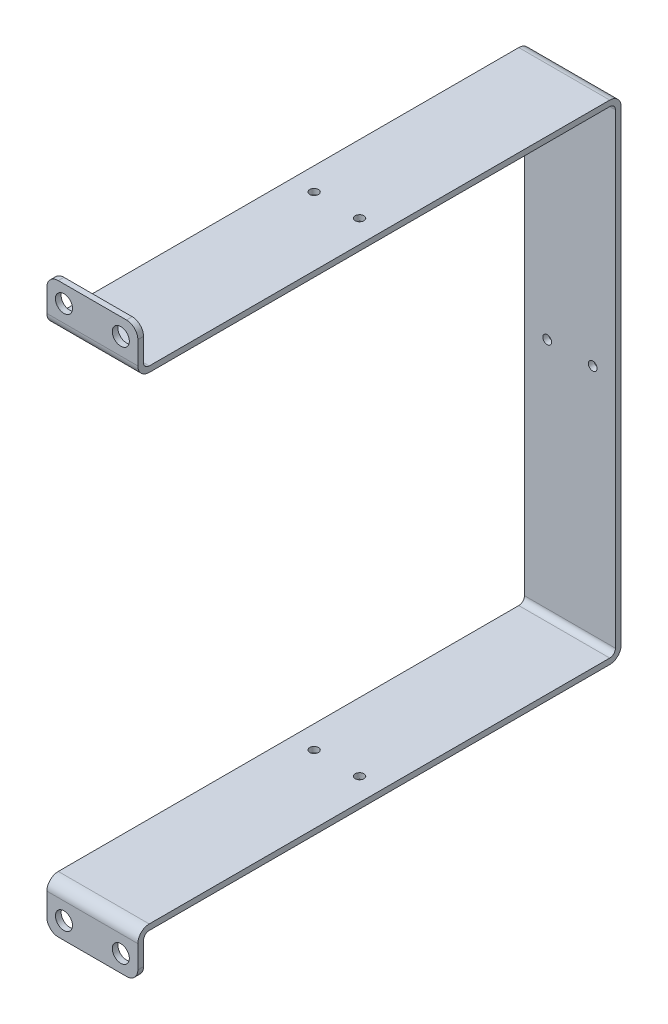
ISO-10303-21;
HEADER;
FILE_DESCRIPTION(('STEP AP214'),'2;1');
FILE_NAME('part.step','',(''),(''),'','','');
FILE_SCHEMA(('AUTOMOTIVE_DESIGN { 1 0 10303 214 1 1 1 1 }'));
ENDSEC;
DATA;
#1=APPLICATION_CONTEXT('core data for automotive mechanical design processes');
#2=APPLICATION_PROTOCOL_DEFINITION('international standard','automotive_design',2000,#1);
#3=PRODUCT_CONTEXT('',#1,'mechanical');
#4=PRODUCT('Part','Part','',(#3));
#5=PRODUCT_RELATED_PRODUCT_CATEGORY('part','',(#4));
#6=PRODUCT_DEFINITION_FORMATION('','',#4);
#7=PRODUCT_DEFINITION_CONTEXT('part definition',#1,'design');
#8=PRODUCT_DEFINITION('design','',#6,#7);
#9=PRODUCT_DEFINITION_SHAPE('','',#8);
#10=(LENGTH_UNIT() NAMED_UNIT(*) SI_UNIT(.MILLI.,.METRE.));
#11=(NAMED_UNIT(*) PLANE_ANGLE_UNIT() SI_UNIT($,.RADIAN.));
#12=(NAMED_UNIT(*) SI_UNIT($,.STERADIAN.) SOLID_ANGLE_UNIT());
#13=UNCERTAINTY_MEASURE_WITH_UNIT(LENGTH_MEASURE(1.E-05),#10,'distance_accuracy_value','');
#14=(GEOMETRIC_REPRESENTATION_CONTEXT(3) GLOBAL_UNCERTAINTY_ASSIGNED_CONTEXT((#13)) GLOBAL_UNIT_ASSIGNED_CONTEXT((#10,
#11,#12)) REPRESENTATION_CONTEXT('',''));
#15=CARTESIAN_POINT('',(0.,0.,0.));
#16=DIRECTION('',(0.,0.,1.));
#17=DIRECTION('',(1.,0.,0.));
#18=AXIS2_PLACEMENT_3D('',#15,#16,#17);
#19=CARTESIAN_POINT('',(50.8,133.35,269.875));
#20=DIRECTION('',(0.,0.,1.));
#21=DIRECTION('',(1.,0.,0.));
#22=AXIS2_PLACEMENT_3D('',#19,#20,#21);
#23=PLANE('',#22);
#24=CARTESIAN_POINT('',(9.525,149.225,269.875));
#25=DIRECTION('',(0.,0.,1.));
#26=DIRECTION('',(1.,0.,0.));
#27=AXIS2_PLACEMENT_3D('',#24,#25,#26);
#28=CIRCLE('',#27,4.7625);
#29=CARTESIAN_POINT('',(14.2875,149.225,269.875));
#30=VERTEX_POINT('',#29);
#31=EDGE_CURVE('E327',#30,#30,#28,.F.);
#32=ORIENTED_EDGE('',*,*,#31,.T.);
#33=EDGE_LOOP('',(#32));
#34=FACE_BOUND('',#33,.T.);
#35=CARTESIAN_POINT('',(41.275,149.225,269.875));
#36=DIRECTION('',(0.,0.,1.));
#37=DIRECTION('',(1.,0.,0.));
#38=AXIS2_PLACEMENT_3D('',#35,#36,#37);
#39=CIRCLE('',#38,4.7625);
#40=CARTESIAN_POINT('',(46.0375,149.225,269.875));
#41=VERTEX_POINT('',#40);
#42=EDGE_CURVE('E331',#41,#41,#39,.F.);
#43=ORIENTED_EDGE('',*,*,#42,.T.);
#44=EDGE_LOOP('',(#43));
#45=FACE_BOUND('',#44,.T.);
#46=DIRECTION('',(0.,1.,0.));
#47=VECTOR('',#46,1.);
#48=CARTESIAN_POINT('',(50.8,149.225,269.875));
#49=LINE('',#48,#47);
#50=CARTESIAN_POINT('',(50.8,152.4,269.875));
#51=VERTEX_POINT('',#50);
#52=CARTESIAN_POINT('',(50.8,139.7,269.875));
#53=VERTEX_POINT('',#52);
#54=EDGE_CURVE('E330',#51,#53,#49,.F.);
#55=ORIENTED_EDGE('',*,*,#54,.F.);
#56=CARTESIAN_POINT('',(44.45,152.4,269.875));
#57=DIRECTION('',(0.,0.,1.));
#58=DIRECTION('',(1.,0.,0.));
#59=AXIS2_PLACEMENT_3D('',#56,#57,#58);
#60=CIRCLE('',#59,6.35);
#61=CARTESIAN_POINT('',(44.45,158.75,269.875));
#62=VERTEX_POINT('',#61);
#63=EDGE_CURVE('E197',#62,#51,#60,.F.);
#64=ORIENTED_EDGE('',*,*,#63,.F.);
#65=DIRECTION('',(1.,0.,0.));
#66=VECTOR('',#65,1.);
#67=CARTESIAN_POINT('',(25.4,158.75,269.875));
#68=LINE('',#67,#66);
#69=CARTESIAN_POINT('',(6.35,158.75,269.875));
#70=VERTEX_POINT('',#69);
#71=EDGE_CURVE('E199',#70,#62,#68,.T.);
#72=ORIENTED_EDGE('',*,*,#71,.F.);
#73=CARTESIAN_POINT('',(6.35,152.4,269.875));
#74=DIRECTION('',(0.,0.,1.));
#75=DIRECTION('',(1.,0.,0.));
#76=AXIS2_PLACEMENT_3D('',#73,#74,#75);
#77=CIRCLE('',#76,6.35);
#78=CARTESIAN_POINT('',(0.,152.4,269.875));
#79=VERTEX_POINT('',#78);
#80=EDGE_CURVE('E334',#79,#70,#77,.F.);
#81=ORIENTED_EDGE('',*,*,#80,.F.);
#82=DIRECTION('',(0.,1.,0.));
#83=VECTOR('',#82,1.);
#84=CARTESIAN_POINT('',(0.,149.225,269.875));
#85=LINE('',#84,#83);
#86=CARTESIAN_POINT('',(0.,139.7,269.875));
#87=VERTEX_POINT('',#86);
#88=EDGE_CURVE('E372',#87,#79,#85,.T.);
#89=ORIENTED_EDGE('',*,*,#88,.F.);
#90=DIRECTION('',(1.,0.,0.));
#91=VECTOR('',#90,1.);
#92=CARTESIAN_POINT('',(0.,139.7,269.875));
#93=LINE('',#92,#91);
#94=EDGE_CURVE('E369',#53,#87,#93,.F.);
#95=ORIENTED_EDGE('',*,*,#94,.F.);
#96=EDGE_LOOP('',(#55,#64,#72,#81,#89,#95));
#97=FACE_BOUND('',#96,.T.);
#98=ADVANCED_FACE('F17',(#34,#45,#97),#23,.T.);
#99=CARTESIAN_POINT('',(0.,-133.35,269.875));
#100=DIRECTION('',(0.,0.,1.));
#101=DIRECTION('',(1.,0.,0.));
#102=AXIS2_PLACEMENT_3D('',#99,#100,#101);
#103=PLANE('',#102);
#104=CARTESIAN_POINT('',(9.525,-149.225,269.875));
#105=DIRECTION('',(0.,0.,-1.));
#106=DIRECTION('',(-1.,0.,0.));
#107=AXIS2_PLACEMENT_3D('',#104,#105,#106);
#108=CIRCLE('',#107,4.7625);
#109=CARTESIAN_POINT('',(4.7625,-149.225,269.875));
#110=VERTEX_POINT('',#109);
#111=EDGE_CURVE('E338',#110,#110,#108,.T.);
#112=ORIENTED_EDGE('',*,*,#111,.T.);
#113=EDGE_LOOP('',(#112));
#114=FACE_BOUND('',#113,.T.);
#115=CARTESIAN_POINT('',(41.275,-149.225,269.875));
#116=DIRECTION('',(0.,0.,-1.));
#117=DIRECTION('',(-1.,0.,0.));
#118=AXIS2_PLACEMENT_3D('',#115,#116,#117);
#119=CIRCLE('',#118,4.7625);
#120=CARTESIAN_POINT('',(36.5125,-149.225,269.875));
#121=VERTEX_POINT('',#120);
#122=EDGE_CURVE('E342',#121,#121,#119,.T.);
#123=ORIENTED_EDGE('',*,*,#122,.T.);
#124=EDGE_LOOP('',(#123));
#125=FACE_BOUND('',#124,.T.);
#126=DIRECTION('',(1.,0.,0.));
#127=VECTOR('',#126,1.);
#128=CARTESIAN_POINT('',(25.4,-158.75,269.875));
#129=LINE('',#128,#127);
#130=CARTESIAN_POINT('',(44.45,-158.75,269.875));
#131=VERTEX_POINT('',#130);
#132=CARTESIAN_POINT('',(6.35,-158.75,269.875));
#133=VERTEX_POINT('',#132);
#134=EDGE_CURVE('E189',#131,#133,#129,.F.);
#135=ORIENTED_EDGE('',*,*,#134,.F.);
#136=CARTESIAN_POINT('',(44.45,-152.4,269.875));
#137=DIRECTION('',(0.,0.,1.));
#138=DIRECTION('',(1.,0.,0.));
#139=AXIS2_PLACEMENT_3D('',#136,#137,#138);
#140=CIRCLE('',#139,6.35);
#141=CARTESIAN_POINT('',(50.8,-152.4,269.875));
#142=VERTEX_POINT('',#141);
#143=EDGE_CURVE('E20',#142,#131,#140,.F.);
#144=ORIENTED_EDGE('',*,*,#143,.F.);
#145=DIRECTION('',(0.,1.,0.));
#146=VECTOR('',#145,1.);
#147=CARTESIAN_POINT('',(50.8,-149.225,269.875));
#148=LINE('',#147,#146);
#149=CARTESIAN_POINT('',(50.8,-139.7,269.875));
#150=VERTEX_POINT('',#149);
#151=EDGE_CURVE('E171',#150,#142,#148,.F.);
#152=ORIENTED_EDGE('',*,*,#151,.F.);
#153=DIRECTION('',(-1.,0.,0.));
#154=VECTOR('',#153,1.);
#155=CARTESIAN_POINT('',(50.8,-139.7,269.875));
#156=LINE('',#155,#154);
#157=CARTESIAN_POINT('',(0.,-139.7,269.875));
#158=VERTEX_POINT('',#157);
#159=EDGE_CURVE('E326',#158,#150,#156,.F.);
#160=ORIENTED_EDGE('',*,*,#159,.F.);
#161=DIRECTION('',(0.,1.,0.));
#162=VECTOR('',#161,1.);
#163=CARTESIAN_POINT('',(0.,-149.225,269.875));
#164=LINE('',#163,#162);
#165=CARTESIAN_POINT('',(0.,-152.4,269.875));
#166=VERTEX_POINT('',#165);
#167=EDGE_CURVE('E341',#166,#158,#164,.T.);
#168=ORIENTED_EDGE('',*,*,#167,.F.);
#169=CARTESIAN_POINT('',(6.35,-152.4,269.875));
#170=DIRECTION('',(0.,0.,1.));
#171=DIRECTION('',(1.,0.,0.));
#172=AXIS2_PLACEMENT_3D('',#169,#170,#171);
#173=CIRCLE('',#172,6.35);
#174=EDGE_CURVE('E193',#133,#166,#173,.F.);
#175=ORIENTED_EDGE('',*,*,#174,.F.);
#176=EDGE_LOOP('',(#135,#144,#152,#160,#168,#175));
#177=FACE_BOUND('',#176,.T.);
#178=ADVANCED_FACE('F187',(#114,#125,#177),#103,.T.);
#179=CARTESIAN_POINT('',(44.45,-152.4,-351.80905));
#180=DIRECTION('',(0.,0.,1.));
#181=DIRECTION('',(1.,0.,0.));
#182=AXIS2_PLACEMENT_3D('',#179,#180,#181);
#183=CYLINDRICAL_SURFACE('',#182,6.35);
#184=DIRECTION('',(0.,0.,-1.));
#185=VECTOR('',#184,1.);
#186=CARTESIAN_POINT('',(50.8,-152.4,268.2875));
#187=LINE('',#186,#185);
#188=CARTESIAN_POINT('',(50.8,-152.4,266.7));
#189=VERTEX_POINT('',#188);
#190=EDGE_CURVE('E176',#142,#189,#187,.T.);
#191=ORIENTED_EDGE('',*,*,#190,.F.);
#192=ORIENTED_EDGE('',*,*,#143,.T.);
#193=DIRECTION('',(0.,0.,-1.));
#194=VECTOR('',#193,1.);
#195=CARTESIAN_POINT('',(44.45,-158.75,268.2875));
#196=LINE('',#195,#194);
#197=CARTESIAN_POINT('',(44.45,-158.75,266.7));
#198=VERTEX_POINT('',#197);
#199=EDGE_CURVE('E344',#198,#131,#196,.F.);
#200=ORIENTED_EDGE('',*,*,#199,.F.);
#201=CARTESIAN_POINT('',(44.45,-152.4,266.7));
#202=DIRECTION('',(0.,0.,1.));
#203=DIRECTION('',(1.,0.,0.));
#204=AXIS2_PLACEMENT_3D('',#201,#202,#203);
#205=CIRCLE('',#204,6.35);
#206=EDGE_CURVE('E196',#198,#189,#205,.T.);
#207=ORIENTED_EDGE('',*,*,#206,.T.);
#208=EDGE_LOOP('',(#191,#192,#200,#207));
#209=FACE_BOUND('',#208,.T.);
#210=ADVANCED_FACE('F195',(#209),#183,.T.);
#211=CARTESIAN_POINT('',(6.35,-152.4,-351.80905));
#212=DIRECTION('',(0.,0.,1.));
#213=DIRECTION('',(1.,0.,0.));
#214=AXIS2_PLACEMENT_3D('',#211,#212,#213);
#215=CYLINDRICAL_SURFACE('',#214,6.35);
#216=DIRECTION('',(0.,0.,-1.));
#217=VECTOR('',#216,1.);
#218=CARTESIAN_POINT('',(6.35,-158.75,268.2875));
#219=LINE('',#218,#217);
#220=CARTESIAN_POINT('',(6.35,-158.75,266.7));
#221=VERTEX_POINT('',#220);
#222=EDGE_CURVE('E206',#133,#221,#219,.T.);
#223=ORIENTED_EDGE('',*,*,#222,.F.);
#224=ORIENTED_EDGE('',*,*,#174,.T.);
#225=DIRECTION('',(0.,0.,1.));
#226=VECTOR('',#225,1.);
#227=CARTESIAN_POINT('',(0.,-152.4,268.2875));
#228=LINE('',#227,#226);
#229=CARTESIAN_POINT('',(0.,-152.4,266.7));
#230=VERTEX_POINT('',#229);
#231=EDGE_CURVE('E183',#230,#166,#228,.T.);
#232=ORIENTED_EDGE('',*,*,#231,.F.);
#233=CARTESIAN_POINT('',(6.35,-152.4,266.7));
#234=DIRECTION('',(0.,0.,1.));
#235=DIRECTION('',(1.,0.,0.));
#236=AXIS2_PLACEMENT_3D('',#233,#234,#235);
#237=CIRCLE('',#236,6.35);
#238=EDGE_CURVE('E320',#230,#221,#237,.T.);
#239=ORIENTED_EDGE('',*,*,#238,.T.);
#240=EDGE_LOOP('',(#223,#224,#232,#239));
#241=FACE_BOUND('',#240,.T.);
#242=ADVANCED_FACE('F348',(#241),#215,.T.);
#243=CARTESIAN_POINT('',(25.4,-158.75,268.2875));
#244=DIRECTION('',(0.,-1.,0.));
#245=DIRECTION('',(0.,0.,-1.));
#246=AXIS2_PLACEMENT_3D('',#243,#244,#245);
#247=PLANE('',#246);
#248=DIRECTION('',(1.,0.,0.));
#249=VECTOR('',#248,1.);
#250=CARTESIAN_POINT('',(0.,-158.75,266.7));
#251=LINE('',#250,#249);
#252=EDGE_CURVE('E319',#221,#198,#251,.T.);
#253=ORIENTED_EDGE('',*,*,#252,.T.);
#254=ORIENTED_EDGE('',*,*,#199,.T.);
#255=ORIENTED_EDGE('',*,*,#134,.T.);
#256=ORIENTED_EDGE('',*,*,#222,.T.);
#257=EDGE_LOOP('',(#253,#254,#255,#256));
#258=FACE_BOUND('',#257,.T.);
#259=ADVANCED_FACE('F360',(#258),#247,.T.);
#260=CARTESIAN_POINT('',(41.275,-149.225,269.875));
#261=DIRECTION('',(0.,0.,-1.));
#262=DIRECTION('',(-1.,0.,0.));
#263=AXIS2_PLACEMENT_3D('',#260,#261,#262);
#264=CYLINDRICAL_SURFACE('',#263,4.7625);
#265=CARTESIAN_POINT('',(41.275,-149.225,266.7));
#266=DIRECTION('',(0.,0.,-1.));
#267=DIRECTION('',(-1.,0.,0.));
#268=AXIS2_PLACEMENT_3D('',#265,#266,#267);
#269=CIRCLE('',#268,4.7625);
#270=CARTESIAN_POINT('',(36.5125,-149.225,266.7));
#271=VERTEX_POINT('',#270);
#272=EDGE_CURVE('E316',#271,#271,#269,.T.);
#273=ORIENTED_EDGE('',*,*,#272,.T.);
#274=EDGE_LOOP('',(#273));
#275=FACE_BOUND('',#274,.T.);
#276=ORIENTED_EDGE('',*,*,#122,.F.);
#277=EDGE_LOOP('',(#276));
#278=FACE_BOUND('',#277,.T.);
#279=ADVANCED_FACE('F746',(#275,#278),#264,.F.);
#280=CARTESIAN_POINT('',(9.525,-149.225,269.875));
#281=DIRECTION('',(0.,0.,-1.));
#282=DIRECTION('',(-1.,0.,0.));
#283=AXIS2_PLACEMENT_3D('',#280,#281,#282);
#284=CYLINDRICAL_SURFACE('',#283,4.7625);
#285=CARTESIAN_POINT('',(9.525,-149.225,266.7));
#286=DIRECTION('',(0.,0.,-1.));
#287=DIRECTION('',(-1.,0.,0.));
#288=AXIS2_PLACEMENT_3D('',#285,#286,#287);
#289=CIRCLE('',#288,4.7625);
#290=CARTESIAN_POINT('',(4.7625,-149.225,266.7));
#291=VERTEX_POINT('',#290);
#292=EDGE_CURVE('E313',#291,#291,#289,.T.);
#293=ORIENTED_EDGE('',*,*,#292,.T.);
#294=EDGE_LOOP('',(#293));
#295=FACE_BOUND('',#294,.T.);
#296=ORIENTED_EDGE('',*,*,#111,.F.);
#297=EDGE_LOOP('',(#296));
#298=FACE_BOUND('',#297,.T.);
#299=ADVANCED_FACE('F737',(#295,#298),#284,.F.);
#300=CARTESIAN_POINT('',(44.45,152.4,-351.80905));
#301=DIRECTION('',(0.,0.,1.));
#302=DIRECTION('',(1.,0.,0.));
#303=AXIS2_PLACEMENT_3D('',#300,#301,#302);
#304=CYLINDRICAL_SURFACE('',#303,6.35);
#305=DIRECTION('',(0.,0.,1.));
#306=VECTOR('',#305,1.);
#307=CARTESIAN_POINT('',(44.45,158.75,268.2875));
#308=LINE('',#307,#306);
#309=CARTESIAN_POINT('',(44.45,158.75,266.7));
#310=VERTEX_POINT('',#309);
#311=EDGE_CURVE('E205',#62,#310,#308,.F.);
#312=ORIENTED_EDGE('',*,*,#311,.F.);
#313=ORIENTED_EDGE('',*,*,#63,.T.);
#314=DIRECTION('',(0.,0.,-1.));
#315=VECTOR('',#314,1.);
#316=CARTESIAN_POINT('',(50.8,152.4,268.2875));
#317=LINE('',#316,#315);
#318=CARTESIAN_POINT('',(50.8,152.4,266.7));
#319=VERTEX_POINT('',#318);
#320=EDGE_CURVE('E374',#319,#51,#317,.F.);
#321=ORIENTED_EDGE('',*,*,#320,.F.);
#322=CARTESIAN_POINT('',(44.45,152.4,266.7));
#323=DIRECTION('',(0.,0.,1.));
#324=DIRECTION('',(1.,0.,0.));
#325=AXIS2_PLACEMENT_3D('',#322,#323,#324);
#326=CIRCLE('',#325,6.35);
#327=EDGE_CURVE('E306',#319,#310,#326,.T.);
#328=ORIENTED_EDGE('',*,*,#327,.T.);
#329=EDGE_LOOP('',(#312,#313,#321,#328));
#330=FACE_BOUND('',#329,.T.);
#331=ADVANCED_FACE('F728',(#330),#304,.T.);
#332=CARTESIAN_POINT('',(25.4,158.75,268.2875));
#333=DIRECTION('',(0.,1.,0.));
#334=DIRECTION('',(0.,0.,1.));
#335=AXIS2_PLACEMENT_3D('',#332,#333,#334);
#336=PLANE('',#335);
#337=ORIENTED_EDGE('',*,*,#71,.T.);
#338=ORIENTED_EDGE('',*,*,#311,.T.);
#339=DIRECTION('',(1.,0.,0.));
#340=VECTOR('',#339,1.);
#341=CARTESIAN_POINT('',(50.8,158.75,266.7));
#342=LINE('',#341,#340);
#343=CARTESIAN_POINT('',(6.35,158.75,266.7));
#344=VERTEX_POINT('',#343);
#345=EDGE_CURVE('E305',#310,#344,#342,.F.);
#346=ORIENTED_EDGE('',*,*,#345,.T.);
#347=DIRECTION('',(0.,0.,1.));
#348=VECTOR('',#347,1.);
#349=CARTESIAN_POINT('',(6.35,158.75,-351.80905));
#350=LINE('',#349,#348);
#351=EDGE_CURVE('E336',#70,#344,#350,.F.);
#352=ORIENTED_EDGE('',*,*,#351,.F.);
#353=EDGE_LOOP('',(#337,#338,#346,#352));
#354=FACE_BOUND('',#353,.T.);
#355=ADVANCED_FACE('F719',(#354),#336,.T.);
#356=CARTESIAN_POINT('',(6.35,152.4,-351.80905));
#357=DIRECTION('',(0.,0.,1.));
#358=DIRECTION('',(1.,0.,0.));
#359=AXIS2_PLACEMENT_3D('',#356,#357,#358);
#360=CYLINDRICAL_SURFACE('',#359,6.35);
#361=DIRECTION('',(0.,0.,1.));
#362=VECTOR('',#361,1.);
#363=CARTESIAN_POINT('',(0.,152.4,268.2875));
#364=LINE('',#363,#362);
#365=CARTESIAN_POINT('',(0.,152.4,266.7));
#366=VERTEX_POINT('',#365);
#367=EDGE_CURVE('E371',#79,#366,#364,.F.);
#368=ORIENTED_EDGE('',*,*,#367,.F.);
#369=ORIENTED_EDGE('',*,*,#80,.T.);
#370=ORIENTED_EDGE('',*,*,#351,.T.);
#371=CARTESIAN_POINT('',(6.35,152.4,266.7));
#372=DIRECTION('',(0.,0.,1.));
#373=DIRECTION('',(1.,0.,0.));
#374=AXIS2_PLACEMENT_3D('',#371,#372,#373);
#375=CIRCLE('',#374,6.35);
#376=EDGE_CURVE('E301',#344,#366,#375,.T.);
#377=ORIENTED_EDGE('',*,*,#376,.T.);
#378=EDGE_LOOP('',(#368,#369,#370,#377));
#379=FACE_BOUND('',#378,.T.);
#380=ADVANCED_FACE('F710',(#379),#360,.T.);
#381=CARTESIAN_POINT('',(41.275,149.225,269.875));
#382=DIRECTION('',(0.,0.,1.));
#383=DIRECTION('',(1.,0.,0.));
#384=AXIS2_PLACEMENT_3D('',#381,#382,#383);
#385=CYLINDRICAL_SURFACE('',#384,4.7625);
#386=ORIENTED_EDGE('',*,*,#42,.F.);
#387=EDGE_LOOP('',(#386));
#388=FACE_BOUND('',#387,.T.);
#389=CARTESIAN_POINT('',(41.275,149.225,266.7));
#390=DIRECTION('',(0.,0.,1.));
#391=DIRECTION('',(1.,0.,0.));
#392=AXIS2_PLACEMENT_3D('',#389,#390,#391);
#393=CIRCLE('',#392,4.7625);
#394=CARTESIAN_POINT('',(46.0375,149.225,266.7));
#395=VERTEX_POINT('',#394);
#396=EDGE_CURVE('E297',#395,#395,#393,.F.);
#397=ORIENTED_EDGE('',*,*,#396,.T.);
#398=EDGE_LOOP('',(#397));
#399=FACE_BOUND('',#398,.T.);
#400=ADVANCED_FACE('F701',(#388,#399),#385,.F.);
#401=CARTESIAN_POINT('',(9.525,149.225,269.875));
#402=DIRECTION('',(0.,0.,1.));
#403=DIRECTION('',(1.,0.,0.));
#404=AXIS2_PLACEMENT_3D('',#401,#402,#403);
#405=CYLINDRICAL_SURFACE('',#404,4.7625);
#406=ORIENTED_EDGE('',*,*,#31,.F.);
#407=EDGE_LOOP('',(#406));
#408=FACE_BOUND('',#407,.T.);
#409=CARTESIAN_POINT('',(9.525,149.225,266.7));
#410=DIRECTION('',(0.,0.,1.));
#411=DIRECTION('',(1.,0.,0.));
#412=AXIS2_PLACEMENT_3D('',#409,#410,#411);
#413=CIRCLE('',#412,4.7625);
#414=CARTESIAN_POINT('',(14.2875,149.225,266.7));
#415=VERTEX_POINT('',#414);
#416=EDGE_CURVE('E294',#415,#415,#413,.F.);
#417=ORIENTED_EDGE('',*,*,#416,.T.);
#418=EDGE_LOOP('',(#417));
#419=FACE_BOUND('',#418,.T.);
#420=ADVANCED_FACE('F692',(#408,#419),#405,.F.);
#421=CARTESIAN_POINT('',(0.,139.7,263.525));
#422=DIRECTION('',(1.,0.,0.));
#423=DIRECTION('',(0.,0.,-1.));
#424=AXIS2_PLACEMENT_3D('',#421,#422,#423);
#425=CYLINDRICAL_SURFACE('',#424,6.35);
#426=CARTESIAN_POINT('',(50.8,139.7,263.525));
#427=DIRECTION('',(1.,0.,0.));
#428=DIRECTION('',(0.,0.,-1.));
#429=AXIS2_PLACEMENT_3D('',#426,#427,#428);
#430=CIRCLE('',#429,6.35);
#431=CARTESIAN_POINT('',(50.8,133.35,263.525));
#432=VERTEX_POINT('',#431);
#433=EDGE_CURVE('E291',#432,#53,#430,.F.);
#434=ORIENTED_EDGE('',*,*,#433,.T.);
#435=ORIENTED_EDGE('',*,*,#94,.T.);
#436=CARTESIAN_POINT('',(0.,139.7,263.525));
#437=DIRECTION('',(1.,0.,0.));
#438=DIRECTION('',(0.,0.,-1.));
#439=AXIS2_PLACEMENT_3D('',#436,#437,#438);
#440=CIRCLE('',#439,6.35);
#441=CARTESIAN_POINT('',(0.,133.35,263.525));
#442=VERTEX_POINT('',#441);
#443=EDGE_CURVE('E287',#442,#87,#440,.F.);
#444=ORIENTED_EDGE('',*,*,#443,.F.);
#445=DIRECTION('',(1.,0.,0.));
#446=VECTOR('',#445,1.);
#447=CARTESIAN_POINT('',(0.,133.35,263.525));
#448=LINE('',#447,#446);
#449=EDGE_CURVE('E290',#442,#432,#448,.T.);
#450=ORIENTED_EDGE('',*,*,#449,.T.);
#451=EDGE_LOOP('',(#434,#435,#444,#450));
#452=FACE_BOUND('',#451,.T.);
#453=ADVANCED_FACE('F684',(#452),#425,.T.);
#454=CARTESIAN_POINT('',(50.8,-139.7,263.525));
#455=DIRECTION('',(-1.,0.,0.));
#456=DIRECTION('',(0.,0.,1.));
#457=AXIS2_PLACEMENT_3D('',#454,#455,#456);
#458=CYLINDRICAL_SURFACE('',#457,6.35);
#459=CARTESIAN_POINT('',(0.,-139.7,263.525));
#460=DIRECTION('',(-1.,0.,0.));
#461=DIRECTION('',(0.,0.,1.));
#462=AXIS2_PLACEMENT_3D('',#459,#460,#461);
#463=CIRCLE('',#462,6.35);
#464=CARTESIAN_POINT('',(0.,-133.35,263.525));
#465=VERTEX_POINT('',#464);
#466=EDGE_CURVE('E310',#465,#158,#463,.F.);
#467=ORIENTED_EDGE('',*,*,#466,.T.);
#468=ORIENTED_EDGE('',*,*,#159,.T.);
#469=CARTESIAN_POINT('',(50.8,-139.7,263.525));
#470=DIRECTION('',(-1.,0.,0.));
#471=DIRECTION('',(0.,0.,1.));
#472=AXIS2_PLACEMENT_3D('',#469,#470,#471);
#473=CIRCLE('',#472,6.35);
#474=CARTESIAN_POINT('',(50.8,-133.35,263.525));
#475=VERTEX_POINT('',#474);
#476=EDGE_CURVE('E180',#475,#150,#473,.F.);
#477=ORIENTED_EDGE('',*,*,#476,.F.);
#478=DIRECTION('',(1.,0.,0.));
#479=VECTOR('',#478,1.);
#480=CARTESIAN_POINT('',(50.8,-133.35,263.525));
#481=LINE('',#480,#479);
#482=EDGE_CURVE('E383',#475,#465,#481,.F.);
#483=ORIENTED_EDGE('',*,*,#482,.T.);
#484=EDGE_LOOP('',(#467,#468,#477,#483));
#485=FACE_BOUND('',#484,.T.);
#486=ADVANCED_FACE('F381',(#485),#458,.T.);
#487=CARTESIAN_POINT('',(0.,-133.35,266.7));
#488=DIRECTION('',(0.,0.,1.));
#489=DIRECTION('',(1.,0.,0.));
#490=AXIS2_PLACEMENT_3D('',#487,#488,#489);
#491=PLANE('',#490);
#492=ORIENTED_EDGE('',*,*,#292,.F.);
#493=EDGE_LOOP('',(#492));
#494=FACE_BOUND('',#493,.T.);
#495=ORIENTED_EDGE('',*,*,#272,.F.);
#496=EDGE_LOOP('',(#495));
#497=FACE_BOUND('',#496,.T.);
#498=ORIENTED_EDGE('',*,*,#238,.F.);
#499=DIRECTION('',(0.,1.,0.));
#500=VECTOR('',#499,1.);
#501=CARTESIAN_POINT('',(0.,-133.35,266.7));
#502=LINE('',#501,#500);
#503=CARTESIAN_POINT('',(0.,-139.7,266.7));
#504=VERTEX_POINT('',#503);
#505=EDGE_CURVE('E323',#504,#230,#502,.F.);
#506=ORIENTED_EDGE('',*,*,#505,.F.);
#507=DIRECTION('',(-1.,0.,0.));
#508=VECTOR('',#507,1.);
#509=CARTESIAN_POINT('',(50.8,-139.7,266.7));
#510=LINE('',#509,#508);
#511=CARTESIAN_POINT('',(50.8,-139.7,266.7));
#512=VERTEX_POINT('',#511);
#513=EDGE_CURVE('E286',#504,#512,#510,.F.);
#514=ORIENTED_EDGE('',*,*,#513,.T.);
#515=DIRECTION('',(0.,1.,0.));
#516=VECTOR('',#515,1.);
#517=CARTESIAN_POINT('',(50.8,-133.35,266.7));
#518=LINE('',#517,#516);
#519=EDGE_CURVE('E325',#189,#512,#518,.T.);
#520=ORIENTED_EDGE('',*,*,#519,.F.);
#521=ORIENTED_EDGE('',*,*,#206,.F.);
#522=ORIENTED_EDGE('',*,*,#252,.F.);
#523=EDGE_LOOP('',(#498,#506,#514,#520,#521,#522));
#524=FACE_BOUND('',#523,.T.);
#525=ADVANCED_FACE('F431',(#494,#497,#524),#491,.F.);
#526=CARTESIAN_POINT('',(50.8,133.35,266.7));
#527=DIRECTION('',(0.,0.,1.));
#528=DIRECTION('',(1.,0.,0.));
#529=AXIS2_PLACEMENT_3D('',#526,#527,#528);
#530=PLANE('',#529);
#531=ORIENTED_EDGE('',*,*,#416,.F.);
#532=EDGE_LOOP('',(#531));
#533=FACE_BOUND('',#532,.T.);
#534=ORIENTED_EDGE('',*,*,#396,.F.);
#535=EDGE_LOOP('',(#534));
#536=FACE_BOUND('',#535,.T.);
#537=DIRECTION('',(1.,0.,0.));
#538=VECTOR('',#537,1.);
#539=CARTESIAN_POINT('',(0.,139.7,266.7));
#540=LINE('',#539,#538);
#541=CARTESIAN_POINT('',(50.8,139.7,266.7));
#542=VERTEX_POINT('',#541);
#543=CARTESIAN_POINT('',(0.,139.7,266.7));
#544=VERTEX_POINT('',#543);
#545=EDGE_CURVE('E272',#542,#544,#540,.F.);
#546=ORIENTED_EDGE('',*,*,#545,.T.);
#547=DIRECTION('',(0.,1.,0.));
#548=VECTOR('',#547,1.);
#549=CARTESIAN_POINT('',(0.,133.35,266.7));
#550=LINE('',#549,#548);
#551=EDGE_CURVE('E304',#366,#544,#550,.F.);
#552=ORIENTED_EDGE('',*,*,#551,.F.);
#553=ORIENTED_EDGE('',*,*,#376,.F.);
#554=ORIENTED_EDGE('',*,*,#345,.F.);
#555=ORIENTED_EDGE('',*,*,#327,.F.);
#556=DIRECTION('',(0.,1.,0.));
#557=VECTOR('',#556,1.);
#558=CARTESIAN_POINT('',(50.8,133.35,266.7));
#559=LINE('',#558,#557);
#560=EDGE_CURVE('E300',#542,#319,#559,.T.);
#561=ORIENTED_EDGE('',*,*,#560,.F.);
#562=EDGE_LOOP('',(#546,#552,#553,#554,#555,#561));
#563=FACE_BOUND('',#562,.T.);
#564=ADVANCED_FACE('F659',(#533,#536,#563),#530,.F.);
#565=CARTESIAN_POINT('',(0.,133.35,0.));
#566=DIRECTION('',(0.,1.,0.));
#567=DIRECTION('',(0.,0.,1.));
#568=AXIS2_PLACEMENT_3D('',#565,#566,#567);
#569=PLANE('',#568);
#570=CARTESIAN_POINT('',(12.7,133.35,133.35));
#571=DIRECTION('',(0.,1.,0.));
#572=DIRECTION('',(0.,0.,1.));
#573=AXIS2_PLACEMENT_3D('',#570,#571,#572);
#574=CIRCLE('',#573,2.4384);
#575=CARTESIAN_POINT('',(12.7,133.35,135.7884));
#576=VERTEX_POINT('',#575);
#577=EDGE_CURVE('E258',#576,#576,#574,.T.);
#578=ORIENTED_EDGE('',*,*,#577,.T.);
#579=EDGE_LOOP('',(#578));
#580=FACE_BOUND('',#579,.T.);
#581=CARTESIAN_POINT('',(38.1,133.35,133.35));
#582=DIRECTION('',(0.,1.,0.));
#583=DIRECTION('',(0.,0.,1.));
#584=AXIS2_PLACEMENT_3D('',#581,#582,#583);
#585=CIRCLE('',#584,2.4384);
#586=CARTESIAN_POINT('',(38.1,133.35,135.7884));
#587=VERTEX_POINT('',#586);
#588=EDGE_CURVE('E262',#587,#587,#585,.T.);
#589=ORIENTED_EDGE('',*,*,#588,.T.);
#590=EDGE_LOOP('',(#589));
#591=FACE_BOUND('',#590,.T.);
#592=DIRECTION('',(0.,0.,-1.));
#593=VECTOR('',#592,1.);
#594=CARTESIAN_POINT('',(50.8,133.35,138.1125));
#595=LINE('',#594,#593);
#596=CARTESIAN_POINT('',(50.8,133.35,6.35));
#597=VERTEX_POINT('',#596);
#598=EDGE_CURVE('E269',#432,#597,#595,.T.);
#599=ORIENTED_EDGE('',*,*,#598,.F.);
#600=ORIENTED_EDGE('',*,*,#449,.F.);
#601=DIRECTION('',(0.,0.,1.));
#602=VECTOR('',#601,1.);
#603=CARTESIAN_POINT('',(0.,133.35,138.1125));
#604=LINE('',#603,#602);
#605=CARTESIAN_POINT('',(0.,133.35,6.35));
#606=VERTEX_POINT('',#605);
#607=EDGE_CURVE('E265',#606,#442,#604,.T.);
#608=ORIENTED_EDGE('',*,*,#607,.F.);
#609=DIRECTION('',(-1.,0.,0.));
#610=VECTOR('',#609,1.);
#611=CARTESIAN_POINT('',(50.8,133.35,6.35));
#612=LINE('',#611,#610);
#613=EDGE_CURVE('E261',#606,#597,#612,.F.);
#614=ORIENTED_EDGE('',*,*,#613,.T.);
#615=EDGE_LOOP('',(#599,#600,#608,#614));
#616=FACE_BOUND('',#615,.T.);
#617=ADVANCED_FACE('F650',(#580,#591,#616),#569,.F.);
#618=CARTESIAN_POINT('',(50.8,-133.35,0.));
#619=DIRECTION('',(0.,-1.,0.));
#620=DIRECTION('',(0.,0.,-1.));
#621=AXIS2_PLACEMENT_3D('',#618,#619,#620);
#622=PLANE('',#621);
#623=CARTESIAN_POINT('',(12.7,-133.35,133.35));
#624=DIRECTION('',(0.,1.,0.));
#625=DIRECTION('',(0.,0.,1.));
#626=AXIS2_PLACEMENT_3D('',#623,#624,#625);
#627=CIRCLE('',#626,2.4384);
#628=CARTESIAN_POINT('',(12.7,-133.35,135.7884));
#629=VERTEX_POINT('',#628);
#630=EDGE_CURVE('E273',#629,#629,#627,.F.);
#631=ORIENTED_EDGE('',*,*,#630,.T.);
#632=EDGE_LOOP('',(#631));
#633=FACE_BOUND('',#632,.T.);
#634=CARTESIAN_POINT('',(38.1,-133.35,133.35));
#635=DIRECTION('',(0.,1.,0.));
#636=DIRECTION('',(0.,0.,1.));
#637=AXIS2_PLACEMENT_3D('',#634,#635,#636);
#638=CIRCLE('',#637,2.4384);
#639=CARTESIAN_POINT('',(38.1,-133.35,135.7884));
#640=VERTEX_POINT('',#639);
#641=EDGE_CURVE('E277',#640,#640,#638,.F.);
#642=ORIENTED_EDGE('',*,*,#641,.T.);
#643=EDGE_LOOP('',(#642));
#644=FACE_BOUND('',#643,.T.);
#645=DIRECTION('',(0.,0.,1.));
#646=VECTOR('',#645,1.);
#647=CARTESIAN_POINT('',(0.,-133.35,138.1125));
#648=LINE('',#647,#646);
#649=CARTESIAN_POINT('',(0.,-133.35,6.35));
#650=VERTEX_POINT('',#649);
#651=EDGE_CURVE('E280',#465,#650,#648,.F.);
#652=ORIENTED_EDGE('',*,*,#651,.F.);
#653=ORIENTED_EDGE('',*,*,#482,.F.);
#654=DIRECTION('',(0.,0.,-1.));
#655=VECTOR('',#654,1.);
#656=CARTESIAN_POINT('',(50.8,-133.35,138.1125));
#657=LINE('',#656,#655);
#658=CARTESIAN_POINT('',(50.8,-133.35,6.35));
#659=VERTEX_POINT('',#658);
#660=EDGE_CURVE('E276',#659,#475,#657,.F.);
#661=ORIENTED_EDGE('',*,*,#660,.F.);
#662=DIRECTION('',(1.,0.,0.));
#663=VECTOR('',#662,1.);
#664=CARTESIAN_POINT('',(0.,-133.35,6.35));
#665=LINE('',#664,#663);
#666=EDGE_CURVE('E257',#659,#650,#665,.F.);
#667=ORIENTED_EDGE('',*,*,#666,.T.);
#668=EDGE_LOOP('',(#652,#653,#661,#667));
#669=FACE_BOUND('',#668,.T.);
#670=ADVANCED_FACE('F392',(#633,#644,#669),#622,.F.);
#671=CARTESIAN_POINT('',(50.8,-139.7,263.525));
#672=DIRECTION('',(-1.,0.,0.));
#673=DIRECTION('',(0.,0.,1.));
#674=AXIS2_PLACEMENT_3D('',#671,#672,#673);
#675=CYLINDRICAL_SURFACE('',#674,3.175);
#676=DIRECTION('',(1.,0.,0.));
#677=VECTOR('',#676,1.);
#678=CARTESIAN_POINT('',(50.8,-136.525,263.525));
#679=LINE('',#678,#677);
#680=CARTESIAN_POINT('',(50.8,-136.525,263.525));
#681=VERTEX_POINT('',#680);
#682=CARTESIAN_POINT('',(0.,-136.525,263.525));
#683=VERTEX_POINT('',#682);
#684=EDGE_CURVE('E256',#681,#683,#679,.F.);
#685=ORIENTED_EDGE('',*,*,#684,.F.);
#686=CARTESIAN_POINT('',(50.8,-139.7,263.525));
#687=DIRECTION('',(-1.,0.,0.));
#688=DIRECTION('',(0.,0.,1.));
#689=AXIS2_PLACEMENT_3D('',#686,#687,#688);
#690=CIRCLE('',#689,3.175);
#691=EDGE_CURVE('E284',#512,#681,#690,.T.);
#692=ORIENTED_EDGE('',*,*,#691,.F.);
#693=ORIENTED_EDGE('',*,*,#513,.F.);
#694=CARTESIAN_POINT('',(0.,-139.7,263.525));
#695=DIRECTION('',(-1.,0.,0.));
#696=DIRECTION('',(0.,0.,1.));
#697=AXIS2_PLACEMENT_3D('',#694,#695,#696);
#698=CIRCLE('',#697,3.175);
#699=EDGE_CURVE('E281',#683,#504,#698,.F.);
#700=ORIENTED_EDGE('',*,*,#699,.F.);
#701=EDGE_LOOP('',(#685,#692,#693,#700));
#702=FACE_BOUND('',#701,.T.);
#703=ADVANCED_FACE('F435',(#702),#675,.F.);
#704=CARTESIAN_POINT('',(38.1,-136.525,133.35));
#705=DIRECTION('',(0.,1.,0.));
#706=DIRECTION('',(0.,0.,1.));
#707=AXIS2_PLACEMENT_3D('',#704,#705,#706);
#708=CYLINDRICAL_SURFACE('',#707,2.4384);
#709=ORIENTED_EDGE('',*,*,#641,.F.);
#710=EDGE_LOOP('',(#709));
#711=FACE_BOUND('',#710,.T.);
#712=CARTESIAN_POINT('',(38.1,-136.525,133.35));
#713=DIRECTION('',(0.,1.,0.));
#714=DIRECTION('',(0.,0.,1.));
#715=AXIS2_PLACEMENT_3D('',#712,#713,#714);
#716=CIRCLE('',#715,2.4384);
#717=CARTESIAN_POINT('',(38.1,-136.525,135.7884));
#718=VERTEX_POINT('',#717);
#719=EDGE_CURVE('E250',#718,#718,#716,.T.);
#720=ORIENTED_EDGE('',*,*,#719,.F.);
#721=EDGE_LOOP('',(#720));
#722=FACE_BOUND('',#721,.T.);
#723=ADVANCED_FACE('F626',(#711,#722),#708,.F.);
#724=CARTESIAN_POINT('',(12.7,-136.525,133.35));
#725=DIRECTION('',(0.,1.,0.));
#726=DIRECTION('',(0.,0.,1.));
#727=AXIS2_PLACEMENT_3D('',#724,#725,#726);
#728=CYLINDRICAL_SURFACE('',#727,2.4384);
#729=ORIENTED_EDGE('',*,*,#630,.F.);
#730=EDGE_LOOP('',(#729));
#731=FACE_BOUND('',#730,.T.);
#732=CARTESIAN_POINT('',(12.7,-136.525,133.35));
#733=DIRECTION('',(0.,1.,0.));
#734=DIRECTION('',(0.,0.,1.));
#735=AXIS2_PLACEMENT_3D('',#732,#733,#734);
#736=CIRCLE('',#735,2.4384);
#737=CARTESIAN_POINT('',(12.7,-136.525,135.7884));
#738=VERTEX_POINT('',#737);
#739=EDGE_CURVE('E247',#738,#738,#736,.T.);
#740=ORIENTED_EDGE('',*,*,#739,.F.);
#741=EDGE_LOOP('',(#740));
#742=FACE_BOUND('',#741,.T.);
#743=ADVANCED_FACE('F617',(#731,#742),#728,.F.);
#744=CARTESIAN_POINT('',(0.,139.7,263.525));
#745=DIRECTION('',(1.,0.,0.));
#746=DIRECTION('',(0.,0.,-1.));
#747=AXIS2_PLACEMENT_3D('',#744,#745,#746);
#748=CYLINDRICAL_SURFACE('',#747,3.175);
#749=DIRECTION('',(1.,0.,0.));
#750=VECTOR('',#749,1.);
#751=CARTESIAN_POINT('',(0.,136.525,263.525));
#752=LINE('',#751,#750);
#753=CARTESIAN_POINT('',(0.,136.525,263.525));
#754=VERTEX_POINT('',#753);
#755=CARTESIAN_POINT('',(50.8,136.525,263.525));
#756=VERTEX_POINT('',#755);
#757=EDGE_CURVE('E241',#754,#756,#752,.T.);
#758=ORIENTED_EDGE('',*,*,#757,.F.);
#759=CARTESIAN_POINT('',(0.,139.7,263.525));
#760=DIRECTION('',(1.,0.,0.));
#761=DIRECTION('',(0.,0.,-1.));
#762=AXIS2_PLACEMENT_3D('',#759,#760,#761);
#763=CIRCLE('',#762,3.175);
#764=EDGE_CURVE('E270',#544,#754,#763,.T.);
#765=ORIENTED_EDGE('',*,*,#764,.F.);
#766=ORIENTED_EDGE('',*,*,#545,.F.);
#767=CARTESIAN_POINT('',(50.8,139.7,263.525));
#768=DIRECTION('',(1.,0.,0.));
#769=DIRECTION('',(0.,0.,-1.));
#770=AXIS2_PLACEMENT_3D('',#767,#768,#769);
#771=CIRCLE('',#770,3.175);
#772=EDGE_CURVE('E266',#756,#542,#771,.F.);
#773=ORIENTED_EDGE('',*,*,#772,.F.);
#774=EDGE_LOOP('',(#758,#765,#766,#773));
#775=FACE_BOUND('',#774,.T.);
#776=ADVANCED_FACE('F608',(#775),#748,.F.);
#777=CARTESIAN_POINT('',(38.1,-136.525,133.35));
#778=DIRECTION('',(0.,1.,0.));
#779=DIRECTION('',(0.,0.,1.));
#780=AXIS2_PLACEMENT_3D('',#777,#778,#779);
#781=CYLINDRICAL_SURFACE('',#780,2.4384);
#782=ORIENTED_EDGE('',*,*,#588,.F.);
#783=EDGE_LOOP('',(#782));
#784=FACE_BOUND('',#783,.T.);
#785=CARTESIAN_POINT('',(38.1,136.525,133.35));
#786=DIRECTION('',(0.,1.,0.));
#787=DIRECTION('',(0.,0.,1.));
#788=AXIS2_PLACEMENT_3D('',#785,#786,#787);
#789=CIRCLE('',#788,2.4384);
#790=CARTESIAN_POINT('',(38.1,136.525,135.7884));
#791=VERTEX_POINT('',#790);
#792=EDGE_CURVE('E234',#791,#791,#789,.F.);
#793=ORIENTED_EDGE('',*,*,#792,.F.);
#794=EDGE_LOOP('',(#793));
#795=FACE_BOUND('',#794,.T.);
#796=ADVANCED_FACE('F599',(#784,#795),#781,.F.);
#797=CARTESIAN_POINT('',(12.7,-136.525,133.35));
#798=DIRECTION('',(0.,1.,0.));
#799=DIRECTION('',(0.,0.,1.));
#800=AXIS2_PLACEMENT_3D('',#797,#798,#799);
#801=CYLINDRICAL_SURFACE('',#800,2.4384);
#802=ORIENTED_EDGE('',*,*,#577,.F.);
#803=EDGE_LOOP('',(#802));
#804=FACE_BOUND('',#803,.T.);
#805=CARTESIAN_POINT('',(12.7,136.525,133.35));
#806=DIRECTION('',(0.,1.,0.));
#807=DIRECTION('',(0.,0.,1.));
#808=AXIS2_PLACEMENT_3D('',#805,#806,#807);
#809=CIRCLE('',#808,2.4384);
#810=CARTESIAN_POINT('',(12.7,136.525,135.7884));
#811=VERTEX_POINT('',#810);
#812=EDGE_CURVE('E230',#811,#811,#809,.F.);
#813=ORIENTED_EDGE('',*,*,#812,.F.);
#814=EDGE_LOOP('',(#813));
#815=FACE_BOUND('',#814,.T.);
#816=ADVANCED_FACE('F590',(#804,#815),#801,.F.);
#817=CARTESIAN_POINT('',(50.8,130.175,6.35));
#818=DIRECTION('',(-1.,0.,0.));
#819=DIRECTION('',(0.,0.,1.));
#820=AXIS2_PLACEMENT_3D('',#817,#818,#819);
#821=CYLINDRICAL_SURFACE('',#820,3.175);
#822=DIRECTION('',(1.,0.,0.));
#823=VECTOR('',#822,1.);
#824=CARTESIAN_POINT('',(0.,130.175,3.175));
#825=LINE('',#824,#823);
#826=CARTESIAN_POINT('',(50.8,130.175,3.175));
#827=VERTEX_POINT('',#826);
#828=CARTESIAN_POINT('',(0.,130.175,3.175));
#829=VERTEX_POINT('',#828);
#830=EDGE_CURVE('E233',#827,#829,#825,.F.);
#831=ORIENTED_EDGE('',*,*,#830,.F.);
#832=CARTESIAN_POINT('',(50.8,130.175,6.35));
#833=DIRECTION('',(-1.,0.,0.));
#834=DIRECTION('',(0.,0.,1.));
#835=AXIS2_PLACEMENT_3D('',#832,#833,#834);
#836=CIRCLE('',#835,3.175);
#837=EDGE_CURVE('E242',#597,#827,#836,.T.);
#838=ORIENTED_EDGE('',*,*,#837,.F.);
#839=ORIENTED_EDGE('',*,*,#613,.F.);
#840=CARTESIAN_POINT('',(0.,130.175,6.35));
#841=DIRECTION('',(-1.,0.,0.));
#842=DIRECTION('',(0.,0.,1.));
#843=AXIS2_PLACEMENT_3D('',#840,#841,#842);
#844=CIRCLE('',#843,3.175);
#845=EDGE_CURVE('E238',#606,#829,#844,.T.);
#846=ORIENTED_EDGE('',*,*,#845,.T.);
#847=EDGE_LOOP('',(#831,#838,#839,#846));
#848=FACE_BOUND('',#847,.T.);
#849=ADVANCED_FACE('F480',(#848),#821,.F.);
#850=CARTESIAN_POINT('',(0.,-130.175,6.35));
#851=DIRECTION('',(1.,0.,0.));
#852=DIRECTION('',(0.,0.,-1.));
#853=AXIS2_PLACEMENT_3D('',#850,#851,#852);
#854=CYLINDRICAL_SURFACE('',#853,3.175);
#855=DIRECTION('',(1.,0.,0.));
#856=VECTOR('',#855,1.);
#857=CARTESIAN_POINT('',(0.,-130.175,3.175));
#858=LINE('',#857,#856);
#859=CARTESIAN_POINT('',(0.,-130.175,3.175));
#860=VERTEX_POINT('',#859);
#861=CARTESIAN_POINT('',(50.8,-130.175,3.175));
#862=VERTEX_POINT('',#861);
#863=EDGE_CURVE('E397',#860,#862,#858,.T.);
#864=ORIENTED_EDGE('',*,*,#863,.F.);
#865=CARTESIAN_POINT('',(0.,-130.175,6.35));
#866=DIRECTION('',(1.,0.,0.));
#867=DIRECTION('',(0.,0.,-1.));
#868=AXIS2_PLACEMENT_3D('',#865,#866,#867);
#869=CIRCLE('',#868,3.175);
#870=EDGE_CURVE('E254',#650,#860,#869,.T.);
#871=ORIENTED_EDGE('',*,*,#870,.F.);
#872=ORIENTED_EDGE('',*,*,#666,.F.);
#873=CARTESIAN_POINT('',(50.8,-130.175,6.35));
#874=DIRECTION('',(1.,0.,0.));
#875=DIRECTION('',(0.,0.,-1.));
#876=AXIS2_PLACEMENT_3D('',#873,#874,#875);
#877=CIRCLE('',#876,3.175);
#878=EDGE_CURVE('E244',#659,#862,#877,.T.);
#879=ORIENTED_EDGE('',*,*,#878,.T.);
#880=EDGE_LOOP('',(#864,#871,#872,#879));
#881=FACE_BOUND('',#880,.T.);
#882=ADVANCED_FACE('F396',(#881),#854,.F.);
#883=CARTESIAN_POINT('',(50.8,-136.525,0.));
#884=DIRECTION('',(0.,-1.,0.));
#885=DIRECTION('',(0.,0.,-1.));
#886=AXIS2_PLACEMENT_3D('',#883,#884,#885);
#887=PLANE('',#886);
#888=ORIENTED_EDGE('',*,*,#739,.T.);
#889=EDGE_LOOP('',(#888));
#890=FACE_BOUND('',#889,.T.);
#891=ORIENTED_EDGE('',*,*,#719,.T.);
#892=EDGE_LOOP('',(#891));
#893=FACE_BOUND('',#892,.T.);
#894=DIRECTION('',(1.,0.,0.));
#895=VECTOR('',#894,1.);
#896=CARTESIAN_POINT('',(0.,-136.525,6.35));
#897=LINE('',#896,#895);
#898=CARTESIAN_POINT('',(50.8,-136.525,6.35));
#899=VERTEX_POINT('',#898);
#900=CARTESIAN_POINT('',(0.,-136.525,6.35));
#901=VERTEX_POINT('',#900);
#902=EDGE_CURVE('E226',#899,#901,#897,.F.);
#903=ORIENTED_EDGE('',*,*,#902,.F.);
#904=DIRECTION('',(0.,0.,-1.));
#905=VECTOR('',#904,1.);
#906=CARTESIAN_POINT('',(50.8,-136.525,0.));
#907=LINE('',#906,#905);
#908=EDGE_CURVE('E253',#899,#681,#907,.F.);
#909=ORIENTED_EDGE('',*,*,#908,.T.);
#910=ORIENTED_EDGE('',*,*,#684,.T.);
#911=DIRECTION('',(0.,0.,-1.));
#912=VECTOR('',#911,1.);
#913=CARTESIAN_POINT('',(0.,-136.525,0.));
#914=LINE('',#913,#912);
#915=EDGE_CURVE('E408',#683,#901,#914,.T.);
#916=ORIENTED_EDGE('',*,*,#915,.T.);
#917=EDGE_LOOP('',(#903,#909,#910,#916));
#918=FACE_BOUND('',#917,.T.);
#919=ADVANCED_FACE('F468',(#890,#893,#918),#887,.T.);
#920=CARTESIAN_POINT('',(0.,136.525,0.));
#921=DIRECTION('',(0.,1.,0.));
#922=DIRECTION('',(0.,0.,1.));
#923=AXIS2_PLACEMENT_3D('',#920,#921,#922);
#924=PLANE('',#923);
#925=ORIENTED_EDGE('',*,*,#812,.T.);
#926=EDGE_LOOP('',(#925));
#927=FACE_BOUND('',#926,.T.);
#928=ORIENTED_EDGE('',*,*,#792,.T.);
#929=EDGE_LOOP('',(#928));
#930=FACE_BOUND('',#929,.T.);
#931=DIRECTION('',(-1.,0.,0.));
#932=VECTOR('',#931,1.);
#933=CARTESIAN_POINT('',(50.8,136.525,6.35));
#934=LINE('',#933,#932);
#935=CARTESIAN_POINT('',(0.,136.525,6.35));
#936=VERTEX_POINT('',#935);
#937=CARTESIAN_POINT('',(50.8,136.525,6.35));
#938=VERTEX_POINT('',#937);
#939=EDGE_CURVE('E218',#936,#938,#934,.F.);
#940=ORIENTED_EDGE('',*,*,#939,.F.);
#941=DIRECTION('',(0.,0.,1.));
#942=VECTOR('',#941,1.);
#943=CARTESIAN_POINT('',(0.,136.525,0.));
#944=LINE('',#943,#942);
#945=EDGE_CURVE('E237',#936,#754,#944,.T.);
#946=ORIENTED_EDGE('',*,*,#945,.T.);
#947=ORIENTED_EDGE('',*,*,#757,.T.);
#948=DIRECTION('',(0.,0.,1.));
#949=VECTOR('',#948,1.);
#950=CARTESIAN_POINT('',(50.8,136.525,0.));
#951=LINE('',#950,#949);
#952=EDGE_CURVE('E412',#756,#938,#951,.F.);
#953=ORIENTED_EDGE('',*,*,#952,.T.);
#954=EDGE_LOOP('',(#940,#946,#947,#953));
#955=FACE_BOUND('',#954,.T.);
#956=ADVANCED_FACE('F470',(#927,#930,#955),#924,.T.);
#957=CARTESIAN_POINT('',(0.,0.,3.175));
#958=DIRECTION('',(0.,0.,1.));
#959=DIRECTION('',(1.,0.,0.));
#960=AXIS2_PLACEMENT_3D('',#957,#958,#959);
#961=PLANE('',#960);
#962=CARTESIAN_POINT('',(38.1,0.,3.175));
#963=DIRECTION('',(0.,0.,1.));
#964=DIRECTION('',(1.,0.,0.));
#965=AXIS2_PLACEMENT_3D('',#962,#963,#964);
#966=CIRCLE('',#965,2.4384);
#967=CARTESIAN_POINT('',(40.5384,0.,3.175));
#968=VERTEX_POINT('',#967);
#969=EDGE_CURVE('E211',#968,#968,#966,.F.);
#970=ORIENTED_EDGE('',*,*,#969,.T.);
#971=EDGE_LOOP('',(#970));
#972=FACE_BOUND('',#971,.T.);
#973=CARTESIAN_POINT('',(12.7,0.,3.175));
#974=DIRECTION('',(0.,0.,1.));
#975=DIRECTION('',(1.,0.,0.));
#976=AXIS2_PLACEMENT_3D('',#973,#974,#975);
#977=CIRCLE('',#976,2.4384);
#978=CARTESIAN_POINT('',(15.1384,0.,3.175));
#979=VERTEX_POINT('',#978);
#980=EDGE_CURVE('E215',#979,#979,#977,.F.);
#981=ORIENTED_EDGE('',*,*,#980,.T.);
#982=EDGE_LOOP('',(#981));
#983=FACE_BOUND('',#982,.T.);
#984=ORIENTED_EDGE('',*,*,#863,.T.);
#985=DIRECTION('',(0.,1.,0.));
#986=VECTOR('',#985,1.);
#987=CARTESIAN_POINT('',(50.8,0.,3.175));
#988=LINE('',#987,#986);
#989=EDGE_CURVE('E223',#862,#827,#988,.T.);
#990=ORIENTED_EDGE('',*,*,#989,.T.);
#991=ORIENTED_EDGE('',*,*,#830,.T.);
#992=DIRECTION('',(0.,1.,0.));
#993=VECTOR('',#992,1.);
#994=CARTESIAN_POINT('',(0.,0.,3.175));
#995=LINE('',#994,#993);
#996=EDGE_CURVE('E229',#829,#860,#995,.F.);
#997=ORIENTED_EDGE('',*,*,#996,.T.);
#998=EDGE_LOOP('',(#984,#990,#991,#997));
#999=FACE_BOUND('',#998,.T.);
#1000=ADVANCED_FACE('F402',(#972,#983,#999),#961,.T.);
#1001=CARTESIAN_POINT('',(0.,0.,1.5875));
#1002=DIRECTION('',(1.,0.,0.));
#1003=DIRECTION('',(0.,0.,-1.));
#1004=AXIS2_PLACEMENT_3D('',#1001,#1002,#1003);
#1005=PLANE('',#1004);
#1006=DIRECTION('',(0.,1.,0.));
#1007=VECTOR('',#1006,1.);
#1008=CARTESIAN_POINT('',(0.,0.,0.));
#1009=LINE('',#1008,#1007);
#1010=CARTESIAN_POINT('',(0.,130.175,0.));
#1011=VERTEX_POINT('',#1010);
#1012=CARTESIAN_POINT('',(0.,-130.175,0.));
#1013=VERTEX_POINT('',#1012);
#1014=EDGE_CURVE('E214',#1011,#1013,#1009,.F.);
#1015=ORIENTED_EDGE('',*,*,#1014,.T.);
#1016=CARTESIAN_POINT('',(0.,-130.175,6.35));
#1017=DIRECTION('',(1.,0.,0.));
#1018=DIRECTION('',(0.,0.,-1.));
#1019=AXIS2_PLACEMENT_3D('',#1016,#1017,#1018);
#1020=CIRCLE('',#1019,6.35);
#1021=EDGE_CURVE('E227',#901,#1013,#1020,.T.);
#1022=ORIENTED_EDGE('',*,*,#1021,.F.);
#1023=ORIENTED_EDGE('',*,*,#915,.F.);
#1024=ORIENTED_EDGE('',*,*,#699,.T.);
#1025=ORIENTED_EDGE('',*,*,#505,.T.);
#1026=ORIENTED_EDGE('',*,*,#231,.T.);
#1027=ORIENTED_EDGE('',*,*,#167,.T.);
#1028=ORIENTED_EDGE('',*,*,#466,.F.);
#1029=ORIENTED_EDGE('',*,*,#651,.T.);
#1030=ORIENTED_EDGE('',*,*,#870,.T.);
#1031=ORIENTED_EDGE('',*,*,#996,.F.);
#1032=ORIENTED_EDGE('',*,*,#845,.F.);
#1033=ORIENTED_EDGE('',*,*,#607,.T.);
#1034=ORIENTED_EDGE('',*,*,#443,.T.);
#1035=ORIENTED_EDGE('',*,*,#88,.T.);
#1036=ORIENTED_EDGE('',*,*,#367,.T.);
#1037=ORIENTED_EDGE('',*,*,#551,.T.);
#1038=ORIENTED_EDGE('',*,*,#764,.T.);
#1039=ORIENTED_EDGE('',*,*,#945,.F.);
#1040=CARTESIAN_POINT('',(0.,130.175,6.35));
#1041=DIRECTION('',(-1.,0.,0.));
#1042=DIRECTION('',(0.,0.,1.));
#1043=AXIS2_PLACEMENT_3D('',#1040,#1041,#1042);
#1044=CIRCLE('',#1043,6.35);
#1045=EDGE_CURVE('E219',#1011,#936,#1044,.F.);
#1046=ORIENTED_EDGE('',*,*,#1045,.F.);
#1047=EDGE_LOOP('',(#1015,#1022,#1023,#1024,#1025,#1026,#1027,#1028,#1029,#1030,#1031,#1032,
#1033,#1034,#1035,#1036,#1037,#1038,#1039,#1046));
#1048=FACE_BOUND('',#1047,.T.);
#1049=ADVANCED_FACE('F354',(#1048),#1005,.F.);
#1050=CARTESIAN_POINT('',(0.,-130.175,6.35));
#1051=DIRECTION('',(1.,0.,0.));
#1052=DIRECTION('',(0.,0.,-1.));
#1053=AXIS2_PLACEMENT_3D('',#1050,#1051,#1052);
#1054=CYLINDRICAL_SURFACE('',#1053,6.35);
#1055=CARTESIAN_POINT('',(50.8,-130.175,6.35));
#1056=DIRECTION('',(1.,0.,0.));
#1057=DIRECTION('',(0.,0.,-1.));
#1058=AXIS2_PLACEMENT_3D('',#1055,#1056,#1057);
#1059=CIRCLE('',#1058,6.35);
#1060=CARTESIAN_POINT('',(50.8,-130.175,0.));
#1061=VERTEX_POINT('',#1060);
#1062=EDGE_CURVE('E224',#1061,#899,#1059,.F.);
#1063=ORIENTED_EDGE('',*,*,#1062,.T.);
#1064=ORIENTED_EDGE('',*,*,#902,.T.);
#1065=ORIENTED_EDGE('',*,*,#1021,.T.);
#1066=DIRECTION('',(1.,0.,0.));
#1067=VECTOR('',#1066,1.);
#1068=CARTESIAN_POINT('',(0.,-130.175,0.));
#1069=LINE('',#1068,#1067);
#1070=EDGE_CURVE('E445',#1013,#1061,#1069,.T.);
#1071=ORIENTED_EDGE('',*,*,#1070,.T.);
#1072=EDGE_LOOP('',(#1063,#1064,#1065,#1071));
#1073=FACE_BOUND('',#1072,.T.);
#1074=ADVANCED_FACE('F463',(#1073),#1054,.T.);
#1075=CARTESIAN_POINT('',(50.8,0.,1.5875));
#1076=DIRECTION('',(-1.,0.,0.));
#1077=DIRECTION('',(0.,0.,1.));
#1078=AXIS2_PLACEMENT_3D('',#1075,#1076,#1077);
#1079=PLANE('',#1078);
#1080=ORIENTED_EDGE('',*,*,#989,.F.);
#1081=ORIENTED_EDGE('',*,*,#878,.F.);
#1082=ORIENTED_EDGE('',*,*,#660,.T.);
#1083=ORIENTED_EDGE('',*,*,#476,.T.);
#1084=ORIENTED_EDGE('',*,*,#151,.T.);
#1085=ORIENTED_EDGE('',*,*,#190,.T.);
#1086=ORIENTED_EDGE('',*,*,#519,.T.);
#1087=ORIENTED_EDGE('',*,*,#691,.T.);
#1088=ORIENTED_EDGE('',*,*,#908,.F.);
#1089=ORIENTED_EDGE('',*,*,#1062,.F.);
#1090=DIRECTION('',(0.,1.,0.));
#1091=VECTOR('',#1090,1.);
#1092=CARTESIAN_POINT('',(50.8,0.,0.));
#1093=LINE('',#1092,#1091);
#1094=CARTESIAN_POINT('',(50.8,130.175,0.));
#1095=VERTEX_POINT('',#1094);
#1096=EDGE_CURVE('E450',#1061,#1095,#1093,.T.);
#1097=ORIENTED_EDGE('',*,*,#1096,.T.);
#1098=CARTESIAN_POINT('',(50.8,130.175,6.35));
#1099=DIRECTION('',(-1.,0.,0.));
#1100=DIRECTION('',(0.,0.,1.));
#1101=AXIS2_PLACEMENT_3D('',#1098,#1099,#1100);
#1102=CIRCLE('',#1101,6.35);
#1103=EDGE_CURVE('E35',#938,#1095,#1102,.T.);
#1104=ORIENTED_EDGE('',*,*,#1103,.F.);
#1105=ORIENTED_EDGE('',*,*,#952,.F.);
#1106=ORIENTED_EDGE('',*,*,#772,.T.);
#1107=ORIENTED_EDGE('',*,*,#560,.T.);
#1108=ORIENTED_EDGE('',*,*,#320,.T.);
#1109=ORIENTED_EDGE('',*,*,#54,.T.);
#1110=ORIENTED_EDGE('',*,*,#433,.F.);
#1111=ORIENTED_EDGE('',*,*,#598,.T.);
#1112=ORIENTED_EDGE('',*,*,#837,.T.);
#1113=EDGE_LOOP('',(#1080,#1081,#1082,#1083,#1084,#1085,#1086,#1087,#1088,#1089,#1097,#1104,
#1105,#1106,#1107,#1108,#1109,#1110,#1111,#1112));
#1114=FACE_BOUND('',#1113,.T.);
#1115=ADVANCED_FACE('F174',(#1114),#1079,.F.);
#1116=CARTESIAN_POINT('',(50.8,130.175,6.35));
#1117=DIRECTION('',(-1.,0.,0.));
#1118=DIRECTION('',(0.,0.,1.));
#1119=AXIS2_PLACEMENT_3D('',#1116,#1117,#1118);
#1120=CYLINDRICAL_SURFACE('',#1119,6.35);
#1121=ORIENTED_EDGE('',*,*,#1045,.T.);
#1122=ORIENTED_EDGE('',*,*,#939,.T.);
#1123=ORIENTED_EDGE('',*,*,#1103,.T.);
#1124=DIRECTION('',(1.,0.,0.));
#1125=VECTOR('',#1124,1.);
#1126=CARTESIAN_POINT('',(0.,130.175,0.));
#1127=LINE('',#1126,#1125);
#1128=EDGE_CURVE('E210',#1095,#1011,#1127,.F.);
#1129=ORIENTED_EDGE('',*,*,#1128,.T.);
#1130=EDGE_LOOP('',(#1121,#1122,#1123,#1129));
#1131=FACE_BOUND('',#1130,.T.);
#1132=ADVANCED_FACE('F498',(#1131),#1120,.T.);
#1133=CARTESIAN_POINT('',(12.7,0.,-26.9875));
#1134=DIRECTION('',(0.,0.,1.));
#1135=DIRECTION('',(1.,0.,0.));
#1136=AXIS2_PLACEMENT_3D('',#1133,#1134,#1135);
#1137=CYLINDRICAL_SURFACE('',#1136,2.4384);
#1138=ORIENTED_EDGE('',*,*,#980,.F.);
#1139=EDGE_LOOP('',(#1138));
#1140=FACE_BOUND('',#1139,.T.);
#1141=CARTESIAN_POINT('',(12.7,0.,0.));
#1142=DIRECTION('',(0.,0.,1.));
#1143=DIRECTION('',(1.,0.,0.));
#1144=AXIS2_PLACEMENT_3D('',#1141,#1142,#1143);
#1145=CIRCLE('',#1144,2.4384);
#1146=CARTESIAN_POINT('',(15.1384,0.,0.));
#1147=VERTEX_POINT('',#1146);
#1148=EDGE_CURVE('E26',#1147,#1147,#1145,.F.);
#1149=ORIENTED_EDGE('',*,*,#1148,.T.);
#1150=EDGE_LOOP('',(#1149));
#1151=FACE_BOUND('',#1150,.T.);
#1152=ADVANCED_FACE('F490',(#1140,#1151),#1137,.F.);
#1153=CARTESIAN_POINT('',(38.1,0.,0.));
#1154=DIRECTION('',(0.,0.,1.));
#1155=DIRECTION('',(1.,0.,0.));
#1156=AXIS2_PLACEMENT_3D('',#1153,#1154,#1155);
#1157=CYLINDRICAL_SURFACE('',#1156,2.4384);
#1158=ORIENTED_EDGE('',*,*,#969,.F.);
#1159=EDGE_LOOP('',(#1158));
#1160=FACE_BOUND('',#1159,.T.);
#1161=CARTESIAN_POINT('',(38.1,0.,0.));
#1162=DIRECTION('',(0.,0.,1.));
#1163=DIRECTION('',(1.,0.,0.));
#1164=AXIS2_PLACEMENT_3D('',#1161,#1162,#1163);
#1165=CIRCLE('',#1164,2.4384);
#1166=CARTESIAN_POINT('',(40.5384,0.,0.));
#1167=VERTEX_POINT('',#1166);
#1168=EDGE_CURVE('E11',#1167,#1167,#1165,.F.);
#1169=ORIENTED_EDGE('',*,*,#1168,.T.);
#1170=EDGE_LOOP('',(#1169));
#1171=FACE_BOUND('',#1170,.T.);
#1172=ADVANCED_FACE('F484',(#1160,#1171),#1157,.F.);
#1173=CARTESIAN_POINT('',(0.,0.,0.));
#1174=DIRECTION('',(0.,0.,1.));
#1175=DIRECTION('',(1.,0.,0.));
#1176=AXIS2_PLACEMENT_3D('',#1173,#1174,#1175);
#1177=PLANE('',#1176);
#1178=ORIENTED_EDGE('',*,*,#1168,.F.);
#1179=EDGE_LOOP('',(#1178));
#1180=FACE_BOUND('',#1179,.T.);
#1181=ORIENTED_EDGE('',*,*,#1148,.F.);
#1182=EDGE_LOOP('',(#1181));
#1183=FACE_BOUND('',#1182,.T.);
#1184=ORIENTED_EDGE('',*,*,#1096,.F.);
#1185=ORIENTED_EDGE('',*,*,#1070,.F.);
#1186=ORIENTED_EDGE('',*,*,#1014,.F.);
#1187=ORIENTED_EDGE('',*,*,#1128,.F.);
#1188=EDGE_LOOP('',(#1184,#1185,#1186,#1187));
#1189=FACE_BOUND('',#1188,.T.);
#1190=ADVANCED_FACE('F466',(#1180,#1183,#1189),#1177,.F.);
#1191=CLOSED_SHELL('',(#98,#178,#210,#242,#259,#279,#299,#331,#355,#380,#400,#420,#453,#486,
#525,#564,#617,#670,#703,#723,#743,#776,#796,#816,#849,#882,#919,#956,#1000,#1049,#1074,#1115,
#1132,#1152,#1172,#1190));
#1192=MANIFOLD_SOLID_BREP('B1',#1191);
#1193=ADVANCED_BREP_SHAPE_REPRESENTATION('',(#18,#1192),#14);
#1194=SHAPE_DEFINITION_REPRESENTATION(#9,#1193);
ENDSEC;
END-ISO-10303-21;
